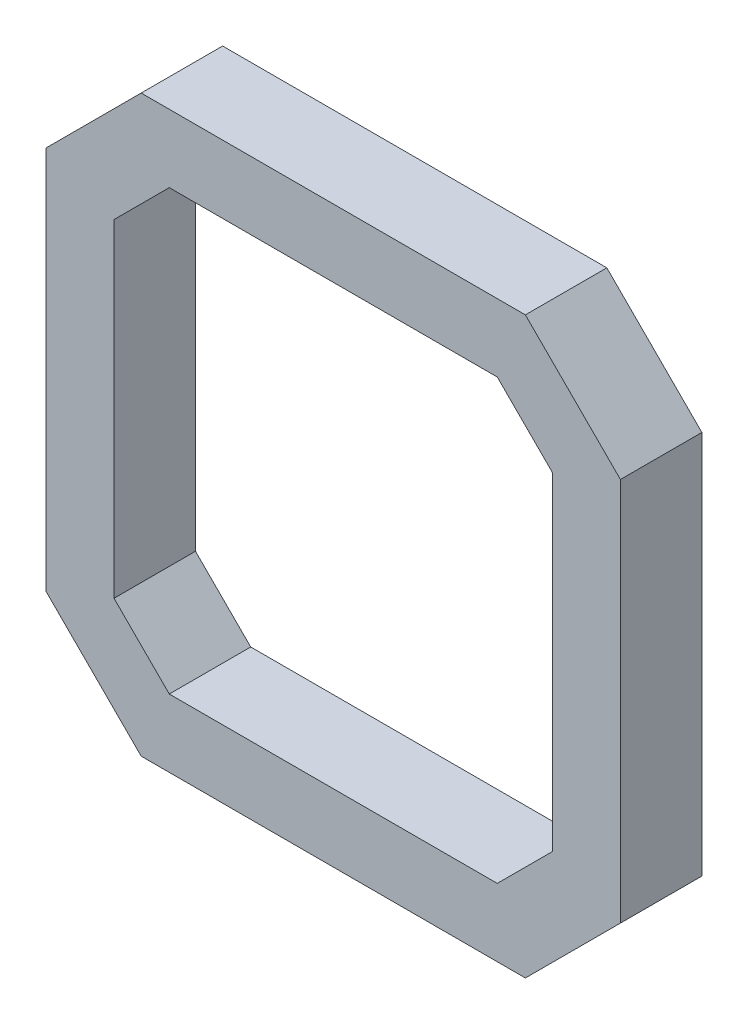
ISO-10303-21;
HEADER;
FILE_DESCRIPTION(('STEP AP214'),'2;1');
FILE_NAME('part.step','',(''),(''),'','','');
FILE_SCHEMA(('AUTOMOTIVE_DESIGN { 1 0 10303 214 1 1 1 1 }'));
ENDSEC;
DATA;
#1=APPLICATION_CONTEXT('core data for automotive mechanical design processes');
#2=APPLICATION_PROTOCOL_DEFINITION('international standard','automotive_design',2000,#1);
#3=PRODUCT_CONTEXT('',#1,'mechanical');
#4=PRODUCT('Part','Part','',(#3));
#5=PRODUCT_RELATED_PRODUCT_CATEGORY('part','',(#4));
#6=PRODUCT_DEFINITION_FORMATION('','',#4);
#7=PRODUCT_DEFINITION_CONTEXT('part definition',#1,'design');
#8=PRODUCT_DEFINITION('design','',#6,#7);
#9=PRODUCT_DEFINITION_SHAPE('','',#8);
#10=(LENGTH_UNIT() NAMED_UNIT(*) SI_UNIT(.MILLI.,.METRE.));
#11=(NAMED_UNIT(*) PLANE_ANGLE_UNIT() SI_UNIT($,.RADIAN.));
#12=(NAMED_UNIT(*) SI_UNIT($,.STERADIAN.) SOLID_ANGLE_UNIT());
#13=UNCERTAINTY_MEASURE_WITH_UNIT(LENGTH_MEASURE(1.E-05),#10,'distance_accuracy_value','');
#14=(GEOMETRIC_REPRESENTATION_CONTEXT(3) GLOBAL_UNCERTAINTY_ASSIGNED_CONTEXT((#13)) GLOBAL_UNIT_ASSIGNED_CONTEXT((#10,
#11,#12)) REPRESENTATION_CONTEXT('',''));
#15=CARTESIAN_POINT('',(0.,0.,0.));
#16=DIRECTION('',(0.,0.,1.));
#17=DIRECTION('',(1.,0.,0.));
#18=AXIS2_PLACEMENT_3D('',#15,#16,#17);
#19=CARTESIAN_POINT('',(0.,0.,6.));
#20=DIRECTION('',(0.,0.,-1.));
#21=DIRECTION('',(-1.,0.,0.));
#22=AXIS2_PLACEMENT_3D('',#19,#20,#21);
#23=PLANE('',#22);
#24=DIRECTION('',(0.,-1.,0.));
#25=VECTOR('',#24,1.);
#26=CARTESIAN_POINT('',(-21.15,-14.15,6.));
#27=LINE('',#26,#25);
#28=CARTESIAN_POINT('',(-21.15,14.15,6.));
#29=VERTEX_POINT('',#28);
#30=CARTESIAN_POINT('',(-21.15,-14.15,6.));
#31=VERTEX_POINT('',#30);
#32=EDGE_CURVE('E211',#29,#31,#27,.T.);
#33=ORIENTED_EDGE('',*,*,#32,.T.);
#34=DIRECTION('',(0.707106781186547,-0.707106781186547,0.));
#35=VECTOR('',#34,1.);
#36=CARTESIAN_POINT('',(-21.15,-14.15,6.));
#37=LINE('',#36,#35);
#38=CARTESIAN_POINT('',(-14.15,-21.15,6.));
#39=VERTEX_POINT('',#38);
#40=EDGE_CURVE('E214',#31,#39,#37,.T.);
#41=ORIENTED_EDGE('',*,*,#40,.T.);
#42=DIRECTION('',(1.,0.,0.));
#43=VECTOR('',#42,1.);
#44=CARTESIAN_POINT('',(-14.15,-21.15,6.));
#45=LINE('',#44,#43);
#46=CARTESIAN_POINT('',(14.15,-21.15,6.));
#47=VERTEX_POINT('',#46);
#48=EDGE_CURVE('E217',#39,#47,#45,.T.);
#49=ORIENTED_EDGE('',*,*,#48,.T.);
#50=DIRECTION('',(0.707106781186547,0.707106781186547,0.));
#51=VECTOR('',#50,1.);
#52=CARTESIAN_POINT('',(14.15,-21.15,6.));
#53=LINE('',#52,#51);
#54=CARTESIAN_POINT('',(21.15,-14.15,6.));
#55=VERTEX_POINT('',#54);
#56=EDGE_CURVE('E219',#47,#55,#53,.T.);
#57=ORIENTED_EDGE('',*,*,#56,.T.);
#58=DIRECTION('',(0.,1.,0.));
#59=VECTOR('',#58,1.);
#60=CARTESIAN_POINT('',(21.15,-14.15,6.));
#61=LINE('',#60,#59);
#62=CARTESIAN_POINT('',(21.15,14.15,6.));
#63=VERTEX_POINT('',#62);
#64=EDGE_CURVE('E221',#55,#63,#61,.T.);
#65=ORIENTED_EDGE('',*,*,#64,.T.);
#66=DIRECTION('',(-0.707106781186547,0.707106781186547,0.));
#67=VECTOR('',#66,1.);
#68=CARTESIAN_POINT('',(14.15,21.15,6.));
#69=LINE('',#68,#67);
#70=CARTESIAN_POINT('',(14.15,21.15,6.));
#71=VERTEX_POINT('',#70);
#72=EDGE_CURVE('E223',#63,#71,#69,.T.);
#73=ORIENTED_EDGE('',*,*,#72,.T.);
#74=DIRECTION('',(-1.,0.,0.));
#75=VECTOR('',#74,1.);
#76=CARTESIAN_POINT('',(-14.15,21.15,6.));
#77=LINE('',#76,#75);
#78=CARTESIAN_POINT('',(-14.15,21.15,6.));
#79=VERTEX_POINT('',#78);
#80=EDGE_CURVE('E225',#71,#79,#77,.T.);
#81=ORIENTED_EDGE('',*,*,#80,.T.);
#82=DIRECTION('',(-0.707106781186547,-0.707106781186547,0.));
#83=VECTOR('',#82,1.);
#84=CARTESIAN_POINT('',(-21.15,14.15,6.));
#85=LINE('',#84,#83);
#86=EDGE_CURVE('E227',#79,#29,#85,.T.);
#87=ORIENTED_EDGE('',*,*,#86,.T.);
#88=EDGE_LOOP('',(#33,#41,#49,#57,#65,#73,#81,#87));
#89=FACE_BOUND('',#88,.T.);
#90=DIRECTION('',(-0.707106781186547,-0.707106781186547,0.));
#91=VECTOR('',#90,1.);
#92=CARTESIAN_POINT('',(-16.15,12.0789321881345,6.));
#93=LINE('',#92,#91);
#94=CARTESIAN_POINT('',(-12.0789321881345,16.15,6.));
#95=VERTEX_POINT('',#94);
#96=CARTESIAN_POINT('',(-16.15,12.0789321881345,6.));
#97=VERTEX_POINT('',#96);
#98=EDGE_CURVE('E146',#95,#97,#93,.T.);
#99=ORIENTED_EDGE('',*,*,#98,.F.);
#100=DIRECTION('',(-1.,0.,0.));
#101=VECTOR('',#100,1.);
#102=CARTESIAN_POINT('',(-12.0789321881345,16.15,6.));
#103=LINE('',#102,#101);
#104=CARTESIAN_POINT('',(12.0789321881345,16.15,6.));
#105=VERTEX_POINT('',#104);
#106=EDGE_CURVE('E179',#105,#95,#103,.T.);
#107=ORIENTED_EDGE('',*,*,#106,.F.);
#108=DIRECTION('',(-0.707106781186547,0.707106781186547,0.));
#109=VECTOR('',#108,1.);
#110=CARTESIAN_POINT('',(12.0789321881345,16.15,6.));
#111=LINE('',#110,#109);
#112=CARTESIAN_POINT('',(16.15,12.0789321881345,6.));
#113=VERTEX_POINT('',#112);
#114=EDGE_CURVE('E177',#113,#105,#111,.T.);
#115=ORIENTED_EDGE('',*,*,#114,.F.);
#116=DIRECTION('',(0.,1.,0.));
#117=VECTOR('',#116,1.);
#118=CARTESIAN_POINT('',(16.15,-12.0789321881345,6.));
#119=LINE('',#118,#117);
#120=CARTESIAN_POINT('',(16.15,-12.0789321881345,6.));
#121=VERTEX_POINT('',#120);
#122=EDGE_CURVE('E175',#121,#113,#119,.T.);
#123=ORIENTED_EDGE('',*,*,#122,.F.);
#124=DIRECTION('',(0.707106781186547,0.707106781186547,0.));
#125=VECTOR('',#124,1.);
#126=CARTESIAN_POINT('',(12.0789321881345,-16.15,6.));
#127=LINE('',#126,#125);
#128=CARTESIAN_POINT('',(12.0789321881345,-16.15,6.));
#129=VERTEX_POINT('',#128);
#130=EDGE_CURVE('E173',#129,#121,#127,.T.);
#131=ORIENTED_EDGE('',*,*,#130,.F.);
#132=DIRECTION('',(1.,0.,0.));
#133=VECTOR('',#132,1.);
#134=CARTESIAN_POINT('',(-12.0789321881345,-16.15,6.));
#135=LINE('',#134,#133);
#136=CARTESIAN_POINT('',(-12.0789321881345,-16.15,6.));
#137=VERTEX_POINT('',#136);
#138=EDGE_CURVE('E169',#137,#129,#135,.T.);
#139=ORIENTED_EDGE('',*,*,#138,.F.);
#140=DIRECTION('',(0.707106781186547,-0.707106781186547,0.));
#141=VECTOR('',#140,1.);
#142=CARTESIAN_POINT('',(-16.15,-12.0789321881345,6.));
#143=LINE('',#142,#141);
#144=CARTESIAN_POINT('',(-16.15,-12.0789321881345,6.));
#145=VERTEX_POINT('',#144);
#146=EDGE_CURVE('E167',#145,#137,#143,.T.);
#147=ORIENTED_EDGE('',*,*,#146,.F.);
#148=DIRECTION('',(0.,-1.,0.));
#149=VECTOR('',#148,1.);
#150=CARTESIAN_POINT('',(-16.15,-12.0789321881345,6.));
#151=LINE('',#150,#149);
#152=EDGE_CURVE('E154',#97,#145,#151,.T.);
#153=ORIENTED_EDGE('',*,*,#152,.F.);
#154=EDGE_LOOP('',(#99,#107,#115,#123,#131,#139,#147,#153));
#155=FACE_BOUND('',#154,.T.);
#156=ADVANCED_FACE('F33',(#89,#155),#23,.F.);
#157=CARTESIAN_POINT('',(0.,0.,0.));
#158=DIRECTION('',(0.,0.,-1.));
#159=DIRECTION('',(-1.,0.,0.));
#160=AXIS2_PLACEMENT_3D('',#157,#158,#159);
#161=PLANE('',#160);
#162=DIRECTION('',(0.,-1.,0.));
#163=VECTOR('',#162,1.);
#164=CARTESIAN_POINT('',(-21.15,-14.15,0.));
#165=LINE('',#164,#163);
#166=CARTESIAN_POINT('',(-21.15,14.15,0.));
#167=VERTEX_POINT('',#166);
#168=CARTESIAN_POINT('',(-21.15,-14.15,0.));
#169=VERTEX_POINT('',#168);
#170=EDGE_CURVE('E162',#167,#169,#165,.T.);
#171=ORIENTED_EDGE('',*,*,#170,.F.);
#172=DIRECTION('',(-0.707106781186547,-0.707106781186547,0.));
#173=VECTOR('',#172,1.);
#174=CARTESIAN_POINT('',(-21.15,14.15,0.));
#175=LINE('',#174,#173);
#176=CARTESIAN_POINT('',(-14.15,21.15,0.));
#177=VERTEX_POINT('',#176);
#178=EDGE_CURVE('E215',#177,#167,#175,.T.);
#179=ORIENTED_EDGE('',*,*,#178,.F.);
#180=DIRECTION('',(-1.,0.,0.));
#181=VECTOR('',#180,1.);
#182=CARTESIAN_POINT('',(-14.15,21.15,0.));
#183=LINE('',#182,#181);
#184=CARTESIAN_POINT('',(14.15,21.15,0.));
#185=VERTEX_POINT('',#184);
#186=EDGE_CURVE('E242',#185,#177,#183,.T.);
#187=ORIENTED_EDGE('',*,*,#186,.F.);
#188=DIRECTION('',(-0.707106781186547,0.707106781186547,0.));
#189=VECTOR('',#188,1.);
#190=CARTESIAN_POINT('',(14.15,21.15,0.));
#191=LINE('',#190,#189);
#192=CARTESIAN_POINT('',(21.15,14.15,0.));
#193=VERTEX_POINT('',#192);
#194=EDGE_CURVE('E240',#193,#185,#191,.T.);
#195=ORIENTED_EDGE('',*,*,#194,.F.);
#196=DIRECTION('',(0.,1.,0.));
#197=VECTOR('',#196,1.);
#198=CARTESIAN_POINT('',(21.15,-14.15,0.));
#199=LINE('',#198,#197);
#200=CARTESIAN_POINT('',(21.15,-14.15,0.));
#201=VERTEX_POINT('',#200);
#202=EDGE_CURVE('E238',#201,#193,#199,.T.);
#203=ORIENTED_EDGE('',*,*,#202,.F.);
#204=DIRECTION('',(0.707106781186547,0.707106781186547,0.));
#205=VECTOR('',#204,1.);
#206=CARTESIAN_POINT('',(14.15,-21.15,0.));
#207=LINE('',#206,#205);
#208=CARTESIAN_POINT('',(14.15,-21.15,0.));
#209=VERTEX_POINT('',#208);
#210=EDGE_CURVE('E236',#209,#201,#207,.T.);
#211=ORIENTED_EDGE('',*,*,#210,.F.);
#212=DIRECTION('',(1.,0.,0.));
#213=VECTOR('',#212,1.);
#214=CARTESIAN_POINT('',(-14.15,-21.15,0.));
#215=LINE('',#214,#213);
#216=CARTESIAN_POINT('',(-14.15,-21.15,0.));
#217=VERTEX_POINT('',#216);
#218=EDGE_CURVE('E234',#217,#209,#215,.T.);
#219=ORIENTED_EDGE('',*,*,#218,.F.);
#220=DIRECTION('',(0.707106781186547,-0.707106781186547,0.));
#221=VECTOR('',#220,1.);
#222=CARTESIAN_POINT('',(-21.15,-14.15,0.));
#223=LINE('',#222,#221);
#224=EDGE_CURVE('E232',#169,#217,#223,.T.);
#225=ORIENTED_EDGE('',*,*,#224,.F.);
#226=EDGE_LOOP('',(#171,#179,#187,#195,#203,#211,#219,#225));
#227=FACE_BOUND('',#226,.T.);
#228=DIRECTION('',(-1.,0.,0.));
#229=VECTOR('',#228,1.);
#230=CARTESIAN_POINT('',(-12.0789321881345,16.15,0.));
#231=LINE('',#230,#229);
#232=CARTESIAN_POINT('',(12.0789321881345,16.15,0.));
#233=VERTEX_POINT('',#232);
#234=CARTESIAN_POINT('',(-12.0789321881345,16.15,0.));
#235=VERTEX_POINT('',#234);
#236=EDGE_CURVE('E155',#233,#235,#231,.T.);
#237=ORIENTED_EDGE('',*,*,#236,.T.);
#238=DIRECTION('',(-0.707106781186547,-0.707106781186547,0.));
#239=VECTOR('',#238,1.);
#240=CARTESIAN_POINT('',(-16.15,12.0789321881345,0.));
#241=LINE('',#240,#239);
#242=CARTESIAN_POINT('',(-16.15,12.0789321881345,0.));
#243=VERTEX_POINT('',#242);
#244=EDGE_CURVE('E56',#235,#243,#241,.T.);
#245=ORIENTED_EDGE('',*,*,#244,.T.);
#246=DIRECTION('',(0.,-1.,0.));
#247=VECTOR('',#246,1.);
#248=CARTESIAN_POINT('',(-16.15,-12.0789321881345,0.));
#249=LINE('',#248,#247);
#250=CARTESIAN_POINT('',(-16.15,-12.0789321881345,0.));
#251=VERTEX_POINT('',#250);
#252=EDGE_CURVE('E161',#243,#251,#249,.T.);
#253=ORIENTED_EDGE('',*,*,#252,.T.);
#254=DIRECTION('',(0.707106781186547,-0.707106781186547,0.));
#255=VECTOR('',#254,1.);
#256=CARTESIAN_POINT('',(-16.15,-12.0789321881345,0.));
#257=LINE('',#256,#255);
#258=CARTESIAN_POINT('',(-12.0789321881345,-16.15,0.));
#259=VERTEX_POINT('',#258);
#260=EDGE_CURVE('E183',#251,#259,#257,.T.);
#261=ORIENTED_EDGE('',*,*,#260,.T.);
#262=DIRECTION('',(1.,0.,0.));
#263=VECTOR('',#262,1.);
#264=CARTESIAN_POINT('',(-12.0789321881345,-16.15,0.));
#265=LINE('',#264,#263);
#266=CARTESIAN_POINT('',(12.0789321881345,-16.15,0.));
#267=VERTEX_POINT('',#266);
#268=EDGE_CURVE('E186',#259,#267,#265,.T.);
#269=ORIENTED_EDGE('',*,*,#268,.T.);
#270=DIRECTION('',(0.707106781186547,0.707106781186547,0.));
#271=VECTOR('',#270,1.);
#272=CARTESIAN_POINT('',(12.0789321881345,-16.15,0.));
#273=LINE('',#272,#271);
#274=CARTESIAN_POINT('',(16.15,-12.0789321881345,0.));
#275=VERTEX_POINT('',#274);
#276=EDGE_CURVE('E189',#267,#275,#273,.T.);
#277=ORIENTED_EDGE('',*,*,#276,.T.);
#278=DIRECTION('',(0.,1.,0.));
#279=VECTOR('',#278,1.);
#280=CARTESIAN_POINT('',(16.15,-12.0789321881345,0.));
#281=LINE('',#280,#279);
#282=CARTESIAN_POINT('',(16.15,12.0789321881345,0.));
#283=VERTEX_POINT('',#282);
#284=EDGE_CURVE('E192',#275,#283,#281,.T.);
#285=ORIENTED_EDGE('',*,*,#284,.T.);
#286=DIRECTION('',(-0.707106781186547,0.707106781186547,0.));
#287=VECTOR('',#286,1.);
#288=CARTESIAN_POINT('',(12.0789321881345,16.15,0.));
#289=LINE('',#288,#287);
#290=EDGE_CURVE('E195',#283,#233,#289,.T.);
#291=ORIENTED_EDGE('',*,*,#290,.T.);
#292=EDGE_LOOP('',(#237,#245,#253,#261,#269,#277,#285,#291));
#293=FACE_BOUND('',#292,.T.);
#294=ADVANCED_FACE('F272',(#227,#293),#161,.T.);
#295=CARTESIAN_POINT('',(-21.15,-14.15,6.));
#296=DIRECTION('',(1.,0.,0.));
#297=DIRECTION('',(0.,0.,-1.));
#298=AXIS2_PLACEMENT_3D('',#295,#296,#297);
#299=PLANE('',#298);
#300=ORIENTED_EDGE('',*,*,#170,.T.);
#301=DIRECTION('',(0.,0.,-1.));
#302=VECTOR('',#301,1.);
#303=CARTESIAN_POINT('',(-21.15,-14.15,6.));
#304=LINE('',#303,#302);
#305=EDGE_CURVE('E11',#31,#169,#304,.T.);
#306=ORIENTED_EDGE('',*,*,#305,.F.);
#307=ORIENTED_EDGE('',*,*,#32,.F.);
#308=DIRECTION('',(0.,0.,-1.));
#309=VECTOR('',#308,1.);
#310=CARTESIAN_POINT('',(-21.15,14.15,6.));
#311=LINE('',#310,#309);
#312=EDGE_CURVE('E229',#29,#167,#311,.T.);
#313=ORIENTED_EDGE('',*,*,#312,.T.);
#314=EDGE_LOOP('',(#300,#306,#307,#313));
#315=FACE_BOUND('',#314,.T.);
#316=ADVANCED_FACE('F35',(#315),#299,.F.);
#317=CARTESIAN_POINT('',(-21.15,-14.15,6.));
#318=DIRECTION('',(0.707106781186548,0.707106781186548,0.));
#319=DIRECTION('',(-0.707106781186548,0.707106781186548,0.));
#320=AXIS2_PLACEMENT_3D('',#317,#318,#319);
#321=PLANE('',#320);
#322=ORIENTED_EDGE('',*,*,#224,.T.);
#323=DIRECTION('',(0.,0.,-1.));
#324=VECTOR('',#323,1.);
#325=CARTESIAN_POINT('',(-14.15,-21.15,6.));
#326=LINE('',#325,#324);
#327=EDGE_CURVE('E41',#39,#217,#326,.T.);
#328=ORIENTED_EDGE('',*,*,#327,.F.);
#329=ORIENTED_EDGE('',*,*,#40,.F.);
#330=ORIENTED_EDGE('',*,*,#305,.T.);
#331=EDGE_LOOP('',(#322,#328,#329,#330));
#332=FACE_BOUND('',#331,.T.);
#333=ADVANCED_FACE('F289',(#332),#321,.F.);
#334=CARTESIAN_POINT('',(-14.15,-21.15,6.));
#335=DIRECTION('',(0.,1.,0.));
#336=DIRECTION('',(0.,0.,1.));
#337=AXIS2_PLACEMENT_3D('',#334,#335,#336);
#338=PLANE('',#337);
#339=ORIENTED_EDGE('',*,*,#218,.T.);
#340=DIRECTION('',(0.,0.,-1.));
#341=VECTOR('',#340,1.);
#342=CARTESIAN_POINT('',(14.15,-21.15,6.));
#343=LINE('',#342,#341);
#344=EDGE_CURVE('E259',#47,#209,#343,.T.);
#345=ORIENTED_EDGE('',*,*,#344,.F.);
#346=ORIENTED_EDGE('',*,*,#48,.F.);
#347=ORIENTED_EDGE('',*,*,#327,.T.);
#348=EDGE_LOOP('',(#339,#345,#346,#347));
#349=FACE_BOUND('',#348,.T.);
#350=ADVANCED_FACE('F266',(#349),#338,.F.);
#351=CARTESIAN_POINT('',(14.15,-21.15,6.));
#352=DIRECTION('',(-0.707106781186548,0.707106781186548,0.));
#353=DIRECTION('',(-0.707106781186548,-0.707106781186548,0.));
#354=AXIS2_PLACEMENT_3D('',#351,#352,#353);
#355=PLANE('',#354);
#356=ORIENTED_EDGE('',*,*,#210,.T.);
#357=DIRECTION('',(0.,0.,-1.));
#358=VECTOR('',#357,1.);
#359=CARTESIAN_POINT('',(21.15,-14.15,6.));
#360=LINE('',#359,#358);
#361=EDGE_CURVE('E256',#55,#201,#360,.T.);
#362=ORIENTED_EDGE('',*,*,#361,.F.);
#363=ORIENTED_EDGE('',*,*,#56,.F.);
#364=ORIENTED_EDGE('',*,*,#344,.T.);
#365=EDGE_LOOP('',(#356,#362,#363,#364));
#366=FACE_BOUND('',#365,.T.);
#367=ADVANCED_FACE('F278',(#366),#355,.F.);
#368=CARTESIAN_POINT('',(21.15,-14.15,6.));
#369=DIRECTION('',(-1.,0.,0.));
#370=DIRECTION('',(0.,0.,1.));
#371=AXIS2_PLACEMENT_3D('',#368,#369,#370);
#372=PLANE('',#371);
#373=ORIENTED_EDGE('',*,*,#202,.T.);
#374=DIRECTION('',(0.,0.,-1.));
#375=VECTOR('',#374,1.);
#376=CARTESIAN_POINT('',(21.15,14.15,6.));
#377=LINE('',#376,#375);
#378=EDGE_CURVE('E253',#63,#193,#377,.T.);
#379=ORIENTED_EDGE('',*,*,#378,.F.);
#380=ORIENTED_EDGE('',*,*,#64,.F.);
#381=ORIENTED_EDGE('',*,*,#361,.T.);
#382=EDGE_LOOP('',(#373,#379,#380,#381));
#383=FACE_BOUND('',#382,.T.);
#384=ADVANCED_FACE('F282',(#383),#372,.F.);
#385=CARTESIAN_POINT('',(14.15,21.15,6.));
#386=DIRECTION('',(-0.707106781186548,-0.707106781186548,0.));
#387=DIRECTION('',(0.707106781186548,-0.707106781186548,0.));
#388=AXIS2_PLACEMENT_3D('',#385,#386,#387);
#389=PLANE('',#388);
#390=ORIENTED_EDGE('',*,*,#194,.T.);
#391=DIRECTION('',(0.,0.,-1.));
#392=VECTOR('',#391,1.);
#393=CARTESIAN_POINT('',(14.15,21.15,6.));
#394=LINE('',#393,#392);
#395=EDGE_CURVE('E250',#71,#185,#394,.T.);
#396=ORIENTED_EDGE('',*,*,#395,.F.);
#397=ORIENTED_EDGE('',*,*,#72,.F.);
#398=ORIENTED_EDGE('',*,*,#378,.T.);
#399=EDGE_LOOP('',(#390,#396,#397,#398));
#400=FACE_BOUND('',#399,.T.);
#401=ADVANCED_FACE('F302',(#400),#389,.F.);
#402=CARTESIAN_POINT('',(-14.15,21.15,6.));
#403=DIRECTION('',(0.,-1.,0.));
#404=DIRECTION('',(0.,0.,-1.));
#405=AXIS2_PLACEMENT_3D('',#402,#403,#404);
#406=PLANE('',#405);
#407=ORIENTED_EDGE('',*,*,#186,.T.);
#408=DIRECTION('',(0.,0.,-1.));
#409=VECTOR('',#408,1.);
#410=CARTESIAN_POINT('',(-14.15,21.15,6.));
#411=LINE('',#410,#409);
#412=EDGE_CURVE('E247',#79,#177,#411,.T.);
#413=ORIENTED_EDGE('',*,*,#412,.F.);
#414=ORIENTED_EDGE('',*,*,#80,.F.);
#415=ORIENTED_EDGE('',*,*,#395,.T.);
#416=EDGE_LOOP('',(#407,#413,#414,#415));
#417=FACE_BOUND('',#416,.T.);
#418=ADVANCED_FACE('F300',(#417),#406,.F.);
#419=CARTESIAN_POINT('',(-21.15,14.15,6.));
#420=DIRECTION('',(0.707106781186548,-0.707106781186548,0.));
#421=DIRECTION('',(0.707106781186548,0.707106781186548,0.));
#422=AXIS2_PLACEMENT_3D('',#419,#420,#421);
#423=PLANE('',#422);
#424=ORIENTED_EDGE('',*,*,#178,.T.);
#425=ORIENTED_EDGE('',*,*,#312,.F.);
#426=ORIENTED_EDGE('',*,*,#86,.F.);
#427=ORIENTED_EDGE('',*,*,#412,.T.);
#428=EDGE_LOOP('',(#424,#425,#426,#427));
#429=FACE_BOUND('',#428,.T.);
#430=ADVANCED_FACE('F295',(#429),#423,.F.);
#431=CARTESIAN_POINT('',(-16.15,12.0789321881345,6.));
#432=DIRECTION('',(0.707106781186548,-0.707106781186548,0.));
#433=DIRECTION('',(0.707106781186548,0.707106781186548,0.));
#434=AXIS2_PLACEMENT_3D('',#431,#432,#433);
#435=PLANE('',#434);
#436=ORIENTED_EDGE('',*,*,#244,.F.);
#437=DIRECTION('',(0.,0.,-1.));
#438=VECTOR('',#437,1.);
#439=CARTESIAN_POINT('',(-12.0789321881345,16.15,6.));
#440=LINE('',#439,#438);
#441=EDGE_CURVE('E150',#95,#235,#440,.T.);
#442=ORIENTED_EDGE('',*,*,#441,.F.);
#443=ORIENTED_EDGE('',*,*,#98,.T.);
#444=DIRECTION('',(0.,0.,-1.));
#445=VECTOR('',#444,1.);
#446=CARTESIAN_POINT('',(-16.15,12.0789321881345,6.));
#447=LINE('',#446,#445);
#448=EDGE_CURVE('E149',#97,#243,#447,.T.);
#449=ORIENTED_EDGE('',*,*,#448,.T.);
#450=EDGE_LOOP('',(#436,#442,#443,#449));
#451=FACE_BOUND('',#450,.T.);
#452=ADVANCED_FACE('F148',(#451),#435,.T.);
#453=CARTESIAN_POINT('',(-16.15,-12.0789321881345,6.));
#454=DIRECTION('',(1.,0.,0.));
#455=DIRECTION('',(0.,0.,-1.));
#456=AXIS2_PLACEMENT_3D('',#453,#454,#455);
#457=PLANE('',#456);
#458=ORIENTED_EDGE('',*,*,#252,.F.);
#459=ORIENTED_EDGE('',*,*,#448,.F.);
#460=ORIENTED_EDGE('',*,*,#152,.T.);
#461=DIRECTION('',(0.,0.,-1.));
#462=VECTOR('',#461,1.);
#463=CARTESIAN_POINT('',(-16.15,-12.0789321881345,6.));
#464=LINE('',#463,#462);
#465=EDGE_CURVE('E163',#145,#251,#464,.T.);
#466=ORIENTED_EDGE('',*,*,#465,.T.);
#467=EDGE_LOOP('',(#458,#459,#460,#466));
#468=FACE_BOUND('',#467,.T.);
#469=ADVANCED_FACE('F158',(#468),#457,.T.);
#470=CARTESIAN_POINT('',(-16.15,-12.0789321881345,6.));
#471=DIRECTION('',(0.707106781186548,0.707106781186548,0.));
#472=DIRECTION('',(-0.707106781186548,0.707106781186548,0.));
#473=AXIS2_PLACEMENT_3D('',#470,#471,#472);
#474=PLANE('',#473);
#475=ORIENTED_EDGE('',*,*,#260,.F.);
#476=ORIENTED_EDGE('',*,*,#465,.F.);
#477=ORIENTED_EDGE('',*,*,#146,.T.);
#478=DIRECTION('',(0.,0.,-1.));
#479=VECTOR('',#478,1.);
#480=CARTESIAN_POINT('',(-12.0789321881345,-16.15,6.));
#481=LINE('',#480,#479);
#482=EDGE_CURVE('E208',#137,#259,#481,.T.);
#483=ORIENTED_EDGE('',*,*,#482,.T.);
#484=EDGE_LOOP('',(#475,#476,#477,#483));
#485=FACE_BOUND('',#484,.T.);
#486=ADVANCED_FACE('F327',(#485),#474,.T.);
#487=CARTESIAN_POINT('',(-12.0789321881345,-16.15,6.));
#488=DIRECTION('',(0.,1.,0.));
#489=DIRECTION('',(0.,0.,1.));
#490=AXIS2_PLACEMENT_3D('',#487,#488,#489);
#491=PLANE('',#490);
#492=ORIENTED_EDGE('',*,*,#268,.F.);
#493=ORIENTED_EDGE('',*,*,#482,.F.);
#494=ORIENTED_EDGE('',*,*,#138,.T.);
#495=DIRECTION('',(0.,0.,-1.));
#496=VECTOR('',#495,1.);
#497=CARTESIAN_POINT('',(12.0789321881345,-16.15,6.));
#498=LINE('',#497,#496);
#499=EDGE_CURVE('E206',#129,#267,#498,.T.);
#500=ORIENTED_EDGE('',*,*,#499,.T.);
#501=EDGE_LOOP('',(#492,#493,#494,#500));
#502=FACE_BOUND('',#501,.T.);
#503=ADVANCED_FACE('F331',(#502),#491,.T.);
#504=CARTESIAN_POINT('',(12.0789321881345,-16.15,6.));
#505=DIRECTION('',(-0.707106781186548,0.707106781186548,0.));
#506=DIRECTION('',(-0.707106781186548,-0.707106781186548,0.));
#507=AXIS2_PLACEMENT_3D('',#504,#505,#506);
#508=PLANE('',#507);
#509=ORIENTED_EDGE('',*,*,#276,.F.);
#510=ORIENTED_EDGE('',*,*,#499,.F.);
#511=ORIENTED_EDGE('',*,*,#130,.T.);
#512=DIRECTION('',(0.,0.,-1.));
#513=VECTOR('',#512,1.);
#514=CARTESIAN_POINT('',(16.15,-12.0789321881345,6.));
#515=LINE('',#514,#513);
#516=EDGE_CURVE('E204',#121,#275,#515,.T.);
#517=ORIENTED_EDGE('',*,*,#516,.T.);
#518=EDGE_LOOP('',(#509,#510,#511,#517));
#519=FACE_BOUND('',#518,.T.);
#520=ADVANCED_FACE('F337',(#519),#508,.T.);
#521=CARTESIAN_POINT('',(16.15,-12.0789321881345,6.));
#522=DIRECTION('',(-1.,0.,0.));
#523=DIRECTION('',(0.,0.,1.));
#524=AXIS2_PLACEMENT_3D('',#521,#522,#523);
#525=PLANE('',#524);
#526=ORIENTED_EDGE('',*,*,#284,.F.);
#527=ORIENTED_EDGE('',*,*,#516,.F.);
#528=ORIENTED_EDGE('',*,*,#122,.T.);
#529=DIRECTION('',(0.,0.,-1.));
#530=VECTOR('',#529,1.);
#531=CARTESIAN_POINT('',(16.15,12.0789321881345,6.));
#532=LINE('',#531,#530);
#533=EDGE_CURVE('E202',#113,#283,#532,.T.);
#534=ORIENTED_EDGE('',*,*,#533,.T.);
#535=EDGE_LOOP('',(#526,#527,#528,#534));
#536=FACE_BOUND('',#535,.T.);
#537=ADVANCED_FACE('F341',(#536),#525,.T.);
#538=CARTESIAN_POINT('',(12.0789321881345,16.15,6.));
#539=DIRECTION('',(-0.707106781186548,-0.707106781186548,0.));
#540=DIRECTION('',(0.707106781186548,-0.707106781186548,0.));
#541=AXIS2_PLACEMENT_3D('',#538,#539,#540);
#542=PLANE('',#541);
#543=ORIENTED_EDGE('',*,*,#290,.F.);
#544=ORIENTED_EDGE('',*,*,#533,.F.);
#545=ORIENTED_EDGE('',*,*,#114,.T.);
#546=DIRECTION('',(0.,0.,-1.));
#547=VECTOR('',#546,1.);
#548=CARTESIAN_POINT('',(12.0789321881345,16.15,6.));
#549=LINE('',#548,#547);
#550=EDGE_CURVE('E48',#105,#233,#549,.T.);
#551=ORIENTED_EDGE('',*,*,#550,.T.);
#552=EDGE_LOOP('',(#543,#544,#545,#551));
#553=FACE_BOUND('',#552,.T.);
#554=ADVANCED_FACE('F345',(#553),#542,.T.);
#555=CARTESIAN_POINT('',(-12.0789321881345,16.15,6.));
#556=DIRECTION('',(0.,-1.,0.));
#557=DIRECTION('',(0.,0.,-1.));
#558=AXIS2_PLACEMENT_3D('',#555,#556,#557);
#559=PLANE('',#558);
#560=ORIENTED_EDGE('',*,*,#236,.F.);
#561=ORIENTED_EDGE('',*,*,#550,.F.);
#562=ORIENTED_EDGE('',*,*,#106,.T.);
#563=ORIENTED_EDGE('',*,*,#441,.T.);
#564=EDGE_LOOP('',(#560,#561,#562,#563));
#565=FACE_BOUND('',#564,.T.);
#566=ADVANCED_FACE('F349',(#565),#559,.T.);
#567=CLOSED_SHELL('',(#156,#294,#316,#333,#350,#367,#384,#401,#418,#430,#452,#469,#486,#503,
#520,#537,#554,#566));
#568=MANIFOLD_SOLID_BREP('B2',#567);
#569=ADVANCED_BREP_SHAPE_REPRESENTATION('',(#18,#568),#14);
#570=SHAPE_DEFINITION_REPRESENTATION(#9,#569);
ENDSEC;
END-ISO-10303-21;
